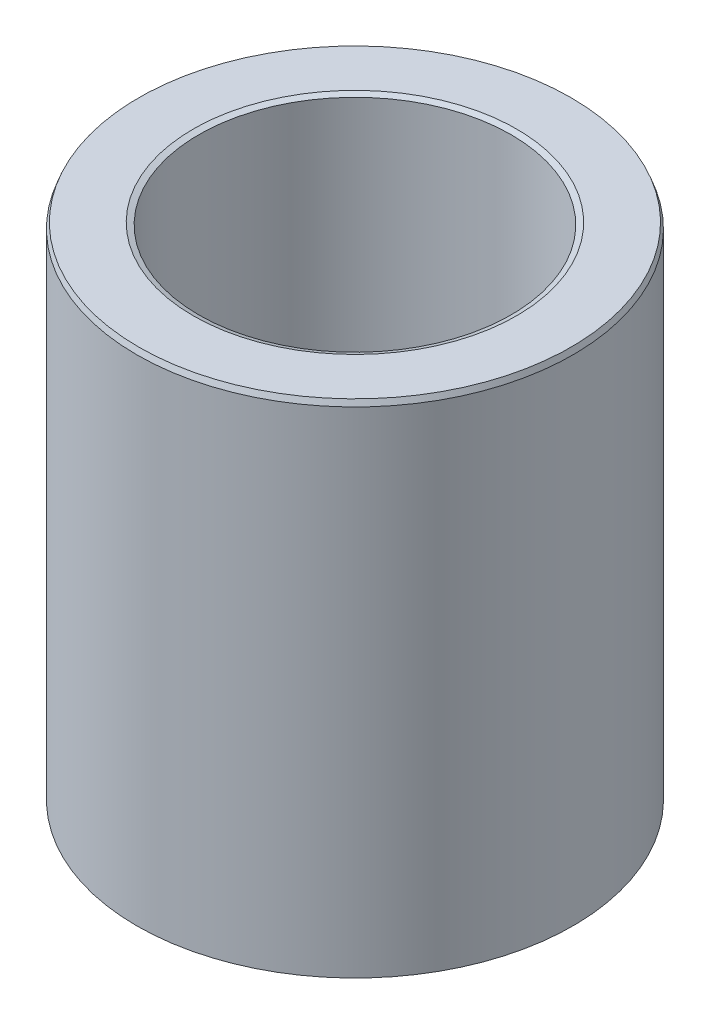
ISO-10303-21;
HEADER;
FILE_DESCRIPTION(('STEP AP214'),'2;1');
FILE_NAME('part.step','',(''),(''),'','','');
FILE_SCHEMA(('AUTOMOTIVE_DESIGN { 1 0 10303 214 1 1 1 1 }'));
ENDSEC;
DATA;
#1=APPLICATION_CONTEXT('core data for automotive mechanical design processes');
#2=APPLICATION_PROTOCOL_DEFINITION('international standard','automotive_design',2000,#1);
#3=PRODUCT_CONTEXT('',#1,'mechanical');
#4=PRODUCT('Part','Part','',(#3));
#5=PRODUCT_RELATED_PRODUCT_CATEGORY('part','',(#4));
#6=PRODUCT_DEFINITION_FORMATION('','',#4);
#7=PRODUCT_DEFINITION_CONTEXT('part definition',#1,'design');
#8=PRODUCT_DEFINITION('design','',#6,#7);
#9=PRODUCT_DEFINITION_SHAPE('','',#8);
#10=(LENGTH_UNIT() NAMED_UNIT(*) SI_UNIT(.MILLI.,.METRE.));
#11=(NAMED_UNIT(*) PLANE_ANGLE_UNIT() SI_UNIT($,.RADIAN.));
#12=(NAMED_UNIT(*) SI_UNIT($,.STERADIAN.) SOLID_ANGLE_UNIT());
#13=UNCERTAINTY_MEASURE_WITH_UNIT(LENGTH_MEASURE(1.E-05),#10,'distance_accuracy_value','');
#14=(GEOMETRIC_REPRESENTATION_CONTEXT(3) GLOBAL_UNCERTAINTY_ASSIGNED_CONTEXT((#13)) GLOBAL_UNIT_ASSIGNED_CONTEXT((#10,
#11,#12)) REPRESENTATION_CONTEXT('',''));
#15=CARTESIAN_POINT('',(0.,0.,0.));
#16=DIRECTION('',(0.,0.,1.));
#17=DIRECTION('',(1.,0.,0.));
#18=AXIS2_PLACEMENT_3D('',#15,#16,#17);
#19=CARTESIAN_POINT('',(0.,34.532272487149,0.));
#20=DIRECTION('',(0.,-1.,0.));
#21=DIRECTION('',(0.,0.,-1.));
#22=AXIS2_PLACEMENT_3D('',#19,#20,#21);
#23=CYLINDRICAL_SURFACE('',#22,15.);
#24=CARTESIAN_POINT('',(0.,0.141691512477247,0.));
#25=DIRECTION('',(0.,1.,0.));
#26=DIRECTION('',(0.,0.,1.));
#27=AXIS2_PLACEMENT_3D('',#24,#25,#26);
#28=CIRCLE('',#27,15.);
#29=CARTESIAN_POINT('',(0.,0.141691512477247,15.));
#30=VERTEX_POINT('',#29);
#31=EDGE_CURVE('E10',#30,#30,#28,.T.);
#32=ORIENTED_EDGE('',*,*,#31,.T.);
#33=EDGE_LOOP('',(#32));
#34=FACE_BOUND('',#33,.T.);
#35=CARTESIAN_POINT('',(0.,34.1483435043517,0.));
#36=DIRECTION('',(0.,1.,0.));
#37=DIRECTION('',(0.,0.,1.));
#38=AXIS2_PLACEMENT_3D('',#35,#36,#37);
#39=CIRCLE('',#38,15.);
#40=CARTESIAN_POINT('',(0.,34.1483435043517,15.));
#41=VERTEX_POINT('',#40);
#42=EDGE_CURVE('E50',#41,#41,#39,.F.);
#43=ORIENTED_EDGE('',*,*,#42,.T.);
#44=EDGE_LOOP('',(#43));
#45=FACE_BOUND('',#44,.T.);
#46=ADVANCED_FACE('F39',(#34,#45),#23,.T.);
#47=CARTESIAN_POINT('',(0.,34.532272487149,0.));
#48=DIRECTION('',(0.,1.,0.));
#49=DIRECTION('',(0.,0.,1.));
#50=AXIS2_PLACEMENT_3D('',#47,#48,#49);
#51=PLANE('',#50);
#52=CARTESIAN_POINT('',(0.,34.532272487149,0.));
#53=DIRECTION('',(0.,1.,0.));
#54=DIRECTION('',(0.,0.,1.));
#55=AXIS2_PLACEMENT_3D('',#52,#53,#54);
#56=CIRCLE('',#55,11.1213670778773);
#57=CARTESIAN_POINT('',(0.,34.532272487149,11.1213670778773));
#58=VERTEX_POINT('',#57);
#59=EDGE_CURVE('E58',#58,#58,#56,.F.);
#60=ORIENTED_EDGE('',*,*,#59,.T.);
#61=EDGE_LOOP('',(#60));
#62=FACE_BOUND('',#61,.T.);
#63=CARTESIAN_POINT('',(0.,34.532272487149,0.));
#64=DIRECTION('',(0.,1.,0.));
#65=DIRECTION('',(0.,0.,1.));
#66=AXIS2_PLACEMENT_3D('',#63,#64,#65);
#67=CIRCLE('',#66,14.8583084875228);
#68=CARTESIAN_POINT('',(0.,34.532272487149,14.8583084875228));
#69=VERTEX_POINT('',#68);
#70=EDGE_CURVE('E61',#69,#69,#67,.T.);
#71=ORIENTED_EDGE('',*,*,#70,.T.);
#72=EDGE_LOOP('',(#71));
#73=FACE_BOUND('',#72,.T.);
#74=ADVANCED_FACE('F88',(#62,#73),#51,.T.);
#75=CARTESIAN_POINT('',(0.,0.,0.));
#76=DIRECTION('',(0.,1.,0.));
#77=DIRECTION('',(0.,0.,1.));
#78=AXIS2_PLACEMENT_3D('',#75,#76,#77);
#79=PLANE('',#78);
#80=CARTESIAN_POINT('',(0.,0.,0.));
#81=DIRECTION('',(0.,1.,0.));
#82=DIRECTION('',(0.,0.,1.));
#83=AXIS2_PLACEMENT_3D('',#80,#81,#82);
#84=CIRCLE('',#83,10.8791296075572);
#85=CARTESIAN_POINT('',(0.,0.,10.8791296075572));
#86=VERTEX_POINT('',#85);
#87=EDGE_CURVE('E51',#86,#86,#84,.T.);
#88=ORIENTED_EDGE('',*,*,#87,.T.);
#89=EDGE_LOOP('',(#88));
#90=FACE_BOUND('',#89,.T.);
#91=CARTESIAN_POINT('',(0.,0.,0.));
#92=DIRECTION('',(0.,1.,0.));
#93=DIRECTION('',(0.,0.,1.));
#94=AXIS2_PLACEMENT_3D('',#91,#92,#93);
#95=CIRCLE('',#94,14.6160710172026);
#96=CARTESIAN_POINT('',(0.,0.,14.6160710172026));
#97=VERTEX_POINT('',#96);
#98=EDGE_CURVE('E54',#97,#97,#95,.F.);
#99=ORIENTED_EDGE('',*,*,#98,.T.);
#100=EDGE_LOOP('',(#99));
#101=FACE_BOUND('',#100,.T.);
#102=ADVANCED_FACE('F83',(#90,#101),#79,.F.);
#103=CARTESIAN_POINT('',(0.,34.532272487149,0.));
#104=DIRECTION('',(0.,-1.,0.));
#105=DIRECTION('',(0.,0.,-1.));
#106=AXIS2_PLACEMENT_3D('',#103,#104,#105);
#107=CYLINDRICAL_SURFACE('',#106,10.7374380950799);
#108=CARTESIAN_POINT('',(0.,34.3905809746718,0.));
#109=DIRECTION('',(0.,1.,0.));
#110=DIRECTION('',(0.,0.,1.));
#111=AXIS2_PLACEMENT_3D('',#108,#109,#110);
#112=CIRCLE('',#111,10.7374380950799);
#113=CARTESIAN_POINT('',(0.,34.3905809746718,10.7374380950799));
#114=VERTEX_POINT('',#113);
#115=EDGE_CURVE('E67',#114,#114,#112,.T.);
#116=ORIENTED_EDGE('',*,*,#115,.T.);
#117=EDGE_LOOP('',(#116));
#118=FACE_BOUND('',#117,.T.);
#119=CARTESIAN_POINT('',(0.,0.38392898279737,0.));
#120=DIRECTION('',(0.,1.,0.));
#121=DIRECTION('',(0.,0.,1.));
#122=AXIS2_PLACEMENT_3D('',#119,#120,#121);
#123=CIRCLE('',#122,10.7374380950799);
#124=CARTESIAN_POINT('',(0.,0.38392898279737,10.7374380950799));
#125=VERTEX_POINT('',#124);
#126=EDGE_CURVE('E69',#125,#125,#123,.F.);
#127=ORIENTED_EDGE('',*,*,#126,.T.);
#128=EDGE_LOOP('',(#127));
#129=FACE_BOUND('',#128,.T.);
#130=ADVANCED_FACE('F71',(#118,#129),#107,.F.);
#131=CARTESIAN_POINT('',(0.,34.3905809746718,0.));
#132=DIRECTION('',(0.,1.,0.));
#133=DIRECTION('',(0.,0.,1.));
#134=AXIS2_PLACEMENT_3D('',#131,#132,#133);
#135=CONICAL_SURFACE('',#134,10.7374380950799,1.21724649144588);
#136=ORIENTED_EDGE('',*,*,#59,.F.);
#137=EDGE_LOOP('',(#136));
#138=FACE_BOUND('',#137,.T.);
#139=ORIENTED_EDGE('',*,*,#115,.F.);
#140=EDGE_LOOP('',(#139));
#141=FACE_BOUND('',#140,.T.);
#142=ADVANCED_FACE('F77',(#138,#141),#135,.F.);
#143=CARTESIAN_POINT('',(0.,0.,0.));
#144=DIRECTION('',(0.,-1.,0.));
#145=DIRECTION('',(0.,0.,-1.));
#146=AXIS2_PLACEMENT_3D('',#143,#144,#145);
#147=CONICAL_SURFACE('',#146,10.8791296075572,0.353549835349004);
#148=ORIENTED_EDGE('',*,*,#126,.F.);
#149=EDGE_LOOP('',(#148));
#150=FACE_BOUND('',#149,.T.);
#151=ORIENTED_EDGE('',*,*,#87,.F.);
#152=EDGE_LOOP('',(#151));
#153=FACE_BOUND('',#152,.T.);
#154=ADVANCED_FACE('F73',(#150,#153),#147,.F.);
#155=CARTESIAN_POINT('',(0.,0.141691512477247,0.));
#156=DIRECTION('',(0.,1.,0.));
#157=DIRECTION('',(0.,0.,1.));
#158=AXIS2_PLACEMENT_3D('',#155,#156,#157);
#159=CONICAL_SURFACE('',#158,15.,1.2172464914459);
#160=ORIENTED_EDGE('',*,*,#98,.F.);
#161=EDGE_LOOP('',(#160));
#162=FACE_BOUND('',#161,.T.);
#163=ORIENTED_EDGE('',*,*,#31,.F.);
#164=EDGE_LOOP('',(#163));
#165=FACE_BOUND('',#164,.T.);
#166=ADVANCED_FACE('F76',(#162,#165),#159,.T.);
#167=CARTESIAN_POINT('',(0.,34.532272487149,0.));
#168=DIRECTION('',(0.,-1.,0.));
#169=DIRECTION('',(0.,0.,-1.));
#170=AXIS2_PLACEMENT_3D('',#167,#168,#169);
#171=CONICAL_SURFACE('',#170,14.8583084875228,0.353549835348994);
#172=ORIENTED_EDGE('',*,*,#42,.F.);
#173=EDGE_LOOP('',(#172));
#174=FACE_BOUND('',#173,.T.);
#175=ORIENTED_EDGE('',*,*,#70,.F.);
#176=EDGE_LOOP('',(#175));
#177=FACE_BOUND('',#176,.T.);
#178=ADVANCED_FACE('F45',(#174,#177),#171,.T.);
#179=CLOSED_SHELL('',(#46,#74,#102,#130,#142,#154,#166,#178));
#180=MANIFOLD_SOLID_BREP('B2',#179);
#181=ADVANCED_BREP_SHAPE_REPRESENTATION('',(#18,#180),#14);
#182=SHAPE_DEFINITION_REPRESENTATION(#9,#181);
ENDSEC;
END-ISO-10303-21;
